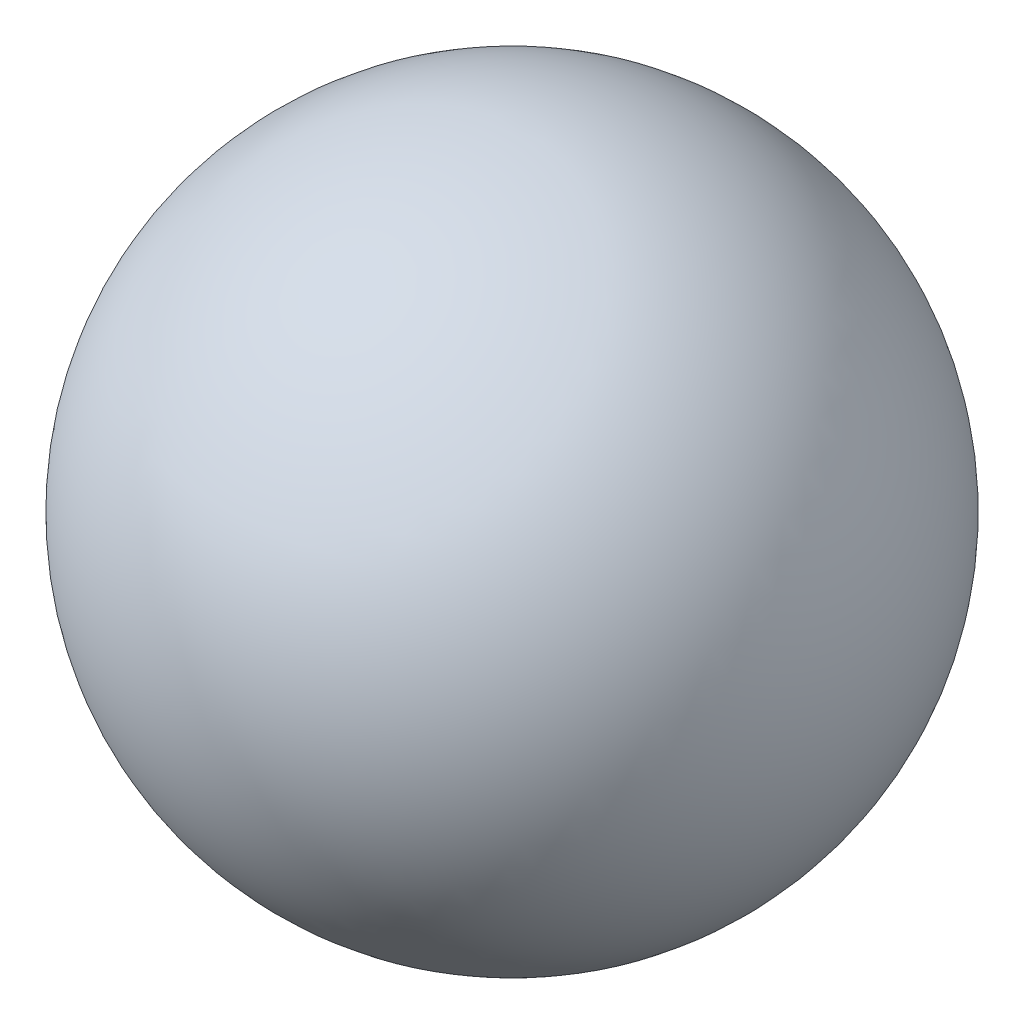
ISO-10303-21;
HEADER;
FILE_DESCRIPTION(('STEP AP214'),'2;1');
FILE_NAME('part.step','',(''),(''),'','','');
FILE_SCHEMA(('AUTOMOTIVE_DESIGN { 1 0 10303 214 1 1 1 1 }'));
ENDSEC;
DATA;
#1=APPLICATION_CONTEXT('core data for automotive mechanical design processes');
#2=APPLICATION_PROTOCOL_DEFINITION('international standard','automotive_design',2000,#1);
#3=PRODUCT_CONTEXT('',#1,'mechanical');
#4=PRODUCT('Part','Part','',(#3));
#5=PRODUCT_RELATED_PRODUCT_CATEGORY('part','',(#4));
#6=PRODUCT_DEFINITION_FORMATION('','',#4);
#7=PRODUCT_DEFINITION_CONTEXT('part definition',#1,'design');
#8=PRODUCT_DEFINITION('design','',#6,#7);
#9=PRODUCT_DEFINITION_SHAPE('','',#8);
#10=(LENGTH_UNIT() NAMED_UNIT(*) SI_UNIT(.MILLI.,.METRE.));
#11=(NAMED_UNIT(*) PLANE_ANGLE_UNIT() SI_UNIT($,.RADIAN.));
#12=(NAMED_UNIT(*) SI_UNIT($,.STERADIAN.) SOLID_ANGLE_UNIT());
#13=UNCERTAINTY_MEASURE_WITH_UNIT(LENGTH_MEASURE(1.E-05),#10,'distance_accuracy_value','');
#14=(GEOMETRIC_REPRESENTATION_CONTEXT(3) GLOBAL_UNCERTAINTY_ASSIGNED_CONTEXT((#13)) GLOBAL_UNIT_ASSIGNED_CONTEXT((#10,
#11,#12)) REPRESENTATION_CONTEXT('',''));
#15=CARTESIAN_POINT('',(0.,0.,0.));
#16=DIRECTION('',(0.,0.,1.));
#17=DIRECTION('',(1.,0.,0.));
#18=AXIS2_PLACEMENT_3D('',#15,#16,#17);
#19=CARTESIAN_POINT('',(0.,0.,0.));
#20=DIRECTION('',(0.,1.,0.));
#21=DIRECTION('',(1.,0.,0.));
#22=AXIS2_PLACEMENT_3D('',#19,#20,#21);
#23=SPHERICAL_SURFACE('',#22,34.);
#24=CARTESIAN_POINT('',(0.,34.,0.));
#25=VERTEX_POINT('',#24);
#26=VERTEX_LOOP('',#25);
#27=FACE_BOUND('',#26,.T.);
#28=ADVANCED_FACE('F33',(#27),#23,.T.);
#29=CLOSED_SHELL('',(#28));
#30=MANIFOLD_SOLID_BREP('B2',#29);
#31=ADVANCED_BREP_SHAPE_REPRESENTATION('',(#18,#30),#14);
#32=SHAPE_DEFINITION_REPRESENTATION(#9,#31);
ENDSEC;
END-ISO-10303-21;
